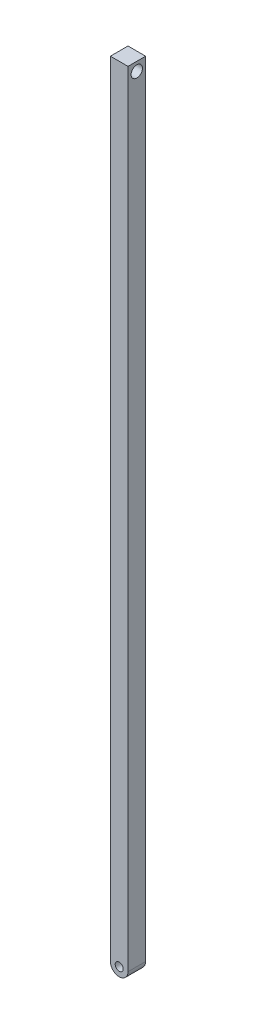
ISO-10303-21;
HEADER;
FILE_DESCRIPTION(('STEP AP214'),'2;1');
FILE_NAME('part.step','',(''),(''),'','','');
FILE_SCHEMA(('AUTOMOTIVE_DESIGN { 1 0 10303 214 1 1 1 1 }'));
ENDSEC;
DATA;
#1=APPLICATION_CONTEXT('core data for automotive mechanical design processes');
#2=APPLICATION_PROTOCOL_DEFINITION('international standard','automotive_design',2000,#1);
#3=PRODUCT_CONTEXT('',#1,'mechanical');
#4=PRODUCT('Part','Part','',(#3));
#5=PRODUCT_RELATED_PRODUCT_CATEGORY('part','',(#4));
#6=PRODUCT_DEFINITION_FORMATION('','',#4);
#7=PRODUCT_DEFINITION_CONTEXT('part definition',#1,'design');
#8=PRODUCT_DEFINITION('design','',#6,#7);
#9=PRODUCT_DEFINITION_SHAPE('','',#8);
#10=(LENGTH_UNIT() NAMED_UNIT(*) SI_UNIT(.MILLI.,.METRE.));
#11=(NAMED_UNIT(*) PLANE_ANGLE_UNIT() SI_UNIT($,.RADIAN.));
#12=(NAMED_UNIT(*) SI_UNIT($,.STERADIAN.) SOLID_ANGLE_UNIT());
#13=UNCERTAINTY_MEASURE_WITH_UNIT(LENGTH_MEASURE(1.E-05),#10,'distance_accuracy_value','');
#14=(GEOMETRIC_REPRESENTATION_CONTEXT(3) GLOBAL_UNCERTAINTY_ASSIGNED_CONTEXT((#13)) GLOBAL_UNIT_ASSIGNED_CONTEXT((#10,
#11,#12)) REPRESENTATION_CONTEXT('',''));
#15=CARTESIAN_POINT('',(0.,0.,0.));
#16=DIRECTION('',(0.,0.,1.));
#17=DIRECTION('',(1.,0.,0.));
#18=AXIS2_PLACEMENT_3D('',#15,#16,#17);
#19=CARTESIAN_POINT('',(3.94377337248894,-66.7561322893268,1.));
#20=DIRECTION('',(0.,0.,1.));
#21=DIRECTION('',(1.,0.,0.));
#22=AXIS2_PLACEMENT_3D('',#19,#20,#21);
#23=PLANE('',#22);
#24=DIRECTION('',(-1.,0.,0.));
#25=VECTOR('',#24,1.);
#26=CARTESIAN_POINT('',(3.44377337248929,-22.256132879046,1.));
#27=LINE('',#26,#25);
#28=CARTESIAN_POINT('',(4.44377337248859,-22.256132879046,1.));
#29=VERTEX_POINT('',#28);
#30=CARTESIAN_POINT('',(3.44377337248929,-22.256132879046,1.));
#31=VERTEX_POINT('',#30);
#32=EDGE_CURVE('E89',#29,#31,#27,.T.);
#33=ORIENTED_EDGE('',*,*,#32,.T.);
#34=DIRECTION('',(0.,-1.,0.));
#35=VECTOR('',#34,1.);
#36=CARTESIAN_POINT('',(3.44377337248929,-22.256132879046,1.));
#37=LINE('',#36,#35);
#38=CARTESIAN_POINT('',(3.4437733724893,-66.7561316995767,1.));
#39=VERTEX_POINT('',#38);
#40=EDGE_CURVE('E84',#31,#39,#37,.T.);
#41=ORIENTED_EDGE('',*,*,#40,.T.);
#42=CARTESIAN_POINT('',(3.94377337248894,-66.7561322893268,1.));
#43=DIRECTION('',(0.,0.,1.));
#44=DIRECTION('',(1.,0.,0.));
#45=AXIS2_PLACEMENT_3D('',#42,#43,#44);
#46=CIRCLE('',#45,0.499999999999994);
#47=CARTESIAN_POINT('',(4.44377337248859,-66.756132879046,1.));
#48=VERTEX_POINT('',#47);
#49=EDGE_CURVE('E87',#39,#48,#46,.T.);
#50=ORIENTED_EDGE('',*,*,#49,.T.);
#51=DIRECTION('',(0.,1.,0.));
#52=VECTOR('',#51,1.);
#53=CARTESIAN_POINT('',(4.44377337248859,-66.756132879046,1.));
#54=LINE('',#53,#52);
#55=EDGE_CURVE('E54',#48,#29,#54,.T.);
#56=ORIENTED_EDGE('',*,*,#55,.T.);
#57=EDGE_LOOP('',(#33,#41,#50,#56));
#58=FACE_BOUND('',#57,.T.);
#59=CARTESIAN_POINT('',(3.94377337248894,-66.7561322893268,1.));
#60=DIRECTION('',(0.,0.,1.));
#61=DIRECTION('',(1.,0.,0.));
#62=AXIS2_PLACEMENT_3D('',#59,#60,#61);
#63=CIRCLE('',#62,0.227761076804634);
#64=CARTESIAN_POINT('',(4.17153444929358,-66.7561322893268,1.));
#65=VERTEX_POINT('',#64);
#66=EDGE_CURVE('E104',#65,#65,#63,.T.);
#67=ORIENTED_EDGE('',*,*,#66,.F.);
#68=EDGE_LOOP('',(#67));
#69=FACE_BOUND('',#68,.T.);
#70=ADVANCED_FACE('F37',(#58,#69),#23,.T.);
#71=CARTESIAN_POINT('',(3.94377337248894,-66.7561322893268,0.));
#72=DIRECTION('',(0.,0.,1.));
#73=DIRECTION('',(1.,0.,0.));
#74=AXIS2_PLACEMENT_3D('',#71,#72,#73);
#75=PLANE('',#74);
#76=DIRECTION('',(-1.,0.,0.));
#77=VECTOR('',#76,1.);
#78=CARTESIAN_POINT('',(3.44377337248929,-22.256132879046,0.));
#79=LINE('',#78,#77);
#80=CARTESIAN_POINT('',(4.44377337248859,-22.256132879046,0.));
#81=VERTEX_POINT('',#80);
#82=CARTESIAN_POINT('',(3.44377337248929,-22.256132879046,0.));
#83=VERTEX_POINT('',#82);
#84=EDGE_CURVE('E101',#81,#83,#79,.T.);
#85=ORIENTED_EDGE('',*,*,#84,.F.);
#86=DIRECTION('',(0.,1.,0.));
#87=VECTOR('',#86,1.);
#88=CARTESIAN_POINT('',(4.44377337248859,-66.756132879046,0.));
#89=LINE('',#88,#87);
#90=CARTESIAN_POINT('',(4.44377337248859,-66.756132879046,0.));
#91=VERTEX_POINT('',#90);
#92=EDGE_CURVE('E77',#91,#81,#89,.T.);
#93=ORIENTED_EDGE('',*,*,#92,.F.);
#94=CARTESIAN_POINT('',(3.94377337248894,-66.7561322893268,0.));
#95=DIRECTION('',(0.,0.,1.));
#96=DIRECTION('',(1.,0.,0.));
#97=AXIS2_PLACEMENT_3D('',#94,#95,#96);
#98=CIRCLE('',#97,0.499999999999994);
#99=CARTESIAN_POINT('',(3.4437733724893,-66.7561316995767,0.));
#100=VERTEX_POINT('',#99);
#101=EDGE_CURVE('E71',#100,#91,#98,.T.);
#102=ORIENTED_EDGE('',*,*,#101,.F.);
#103=DIRECTION('',(0.,-1.,0.));
#104=VECTOR('',#103,1.);
#105=CARTESIAN_POINT('',(3.44377337248929,-22.256132879046,0.));
#106=LINE('',#105,#104);
#107=EDGE_CURVE('E93',#83,#100,#106,.T.);
#108=ORIENTED_EDGE('',*,*,#107,.F.);
#109=EDGE_LOOP('',(#85,#93,#102,#108));
#110=FACE_BOUND('',#109,.T.);
#111=CARTESIAN_POINT('',(3.94377337248894,-66.7561322893268,0.));
#112=DIRECTION('',(0.,0.,1.));
#113=DIRECTION('',(1.,0.,0.));
#114=AXIS2_PLACEMENT_3D('',#111,#112,#113);
#115=CIRCLE('',#114,0.227761076804634);
#116=CARTESIAN_POINT('',(4.17153444929358,-66.7561322893268,0.));
#117=VERTEX_POINT('',#116);
#118=EDGE_CURVE('E116',#117,#117,#115,.T.);
#119=ORIENTED_EDGE('',*,*,#118,.T.);
#120=EDGE_LOOP('',(#119));
#121=FACE_BOUND('',#120,.T.);
#122=ADVANCED_FACE('F112',(#110,#121),#75,.F.);
#123=CARTESIAN_POINT('',(3.44377337248929,-22.256132879046,1.));
#124=DIRECTION('',(0.,-1.,0.));
#125=DIRECTION('',(0.,0.,-1.));
#126=AXIS2_PLACEMENT_3D('',#123,#124,#125);
#127=PLANE('',#126);
#128=ORIENTED_EDGE('',*,*,#84,.T.);
#129=DIRECTION('',(0.,0.,-1.));
#130=VECTOR('',#129,1.);
#131=CARTESIAN_POINT('',(3.44377337248929,-22.256132879046,1.));
#132=LINE('',#131,#130);
#133=EDGE_CURVE('E11',#31,#83,#132,.T.);
#134=ORIENTED_EDGE('',*,*,#133,.F.);
#135=ORIENTED_EDGE('',*,*,#32,.F.);
#136=DIRECTION('',(0.,0.,-1.));
#137=VECTOR('',#136,1.);
#138=CARTESIAN_POINT('',(4.44377337248859,-22.256132879046,1.));
#139=LINE('',#138,#137);
#140=EDGE_CURVE('E97',#29,#81,#139,.T.);
#141=ORIENTED_EDGE('',*,*,#140,.T.);
#142=EDGE_LOOP('',(#128,#134,#135,#141));
#143=FACE_BOUND('',#142,.T.);
#144=ADVANCED_FACE('F39',(#143),#127,.F.);
#145=CARTESIAN_POINT('',(3.44377337248929,-22.256132879046,1.));
#146=DIRECTION('',(1.,0.,0.));
#147=DIRECTION('',(0.,1.,0.));
#148=AXIS2_PLACEMENT_3D('',#145,#146,#147);
#149=PLANE('',#148);
#150=CARTESIAN_POINT('',(3.44377337248895,-22.756132879046,0.5));
#151=DIRECTION('',(1.,0.,0.));
#152=DIRECTION('',(0.,1.,0.));
#153=AXIS2_PLACEMENT_3D('',#150,#151,#152);
#154=CIRCLE('',#153,0.323069994028577);
#155=CARTESIAN_POINT('',(3.44377337248895,-22.4330628850174,0.5));
#156=VERTEX_POINT('',#155);
#157=EDGE_CURVE('E119',#156,#156,#154,.T.);
#158=ORIENTED_EDGE('',*,*,#157,.T.);
#159=EDGE_LOOP('',(#158));
#160=FACE_BOUND('',#159,.T.);
#161=ORIENTED_EDGE('',*,*,#107,.T.);
#162=DIRECTION('',(0.,0.,-1.));
#163=VECTOR('',#162,1.);
#164=CARTESIAN_POINT('',(3.4437733724893,-66.7561316995767,1.));
#165=LINE('',#164,#163);
#166=EDGE_CURVE('E46',#39,#100,#165,.T.);
#167=ORIENTED_EDGE('',*,*,#166,.F.);
#168=ORIENTED_EDGE('',*,*,#40,.F.);
#169=ORIENTED_EDGE('',*,*,#133,.T.);
#170=EDGE_LOOP('',(#161,#167,#168,#169));
#171=FACE_BOUND('',#170,.T.);
#172=ADVANCED_FACE('F92',(#160,#171),#149,.F.);
#173=CARTESIAN_POINT('',(3.94377337248894,-66.7561322893268,1.));
#174=DIRECTION('',(0.,0.,-1.));
#175=DIRECTION('',(-1.,0.,0.));
#176=AXIS2_PLACEMENT_3D('',#173,#174,#175);
#177=CYLINDRICAL_SURFACE('',#176,0.499999999999994);
#178=ORIENTED_EDGE('',*,*,#101,.T.);
#179=DIRECTION('',(0.,0.,-1.));
#180=VECTOR('',#179,1.);
#181=CARTESIAN_POINT('',(4.44377337248859,-66.756132879046,1.));
#182=LINE('',#181,#180);
#183=EDGE_CURVE('E94',#48,#91,#182,.T.);
#184=ORIENTED_EDGE('',*,*,#183,.F.);
#185=ORIENTED_EDGE('',*,*,#49,.F.);
#186=ORIENTED_EDGE('',*,*,#166,.T.);
#187=EDGE_LOOP('',(#178,#184,#185,#186));
#188=FACE_BOUND('',#187,.T.);
#189=ADVANCED_FACE('F95',(#188),#177,.T.);
#190=CARTESIAN_POINT('',(4.44377337248859,-66.756132879046,1.));
#191=DIRECTION('',(-1.,0.,0.));
#192=DIRECTION('',(0.,-1.,0.));
#193=AXIS2_PLACEMENT_3D('',#190,#191,#192);
#194=PLANE('',#193);
#195=CARTESIAN_POINT('',(4.44377337248859,-22.756132879046,0.5));
#196=DIRECTION('',(1.,0.,0.));
#197=DIRECTION('',(0.,1.,0.));
#198=AXIS2_PLACEMENT_3D('',#195,#196,#197);
#199=CIRCLE('',#198,0.323069994028577);
#200=CARTESIAN_POINT('',(4.44377337248859,-22.4330628850174,0.5));
#201=VERTEX_POINT('',#200);
#202=EDGE_CURVE('E122',#201,#201,#199,.T.);
#203=ORIENTED_EDGE('',*,*,#202,.F.);
#204=EDGE_LOOP('',(#203));
#205=FACE_BOUND('',#204,.T.);
#206=ORIENTED_EDGE('',*,*,#92,.T.);
#207=ORIENTED_EDGE('',*,*,#140,.F.);
#208=ORIENTED_EDGE('',*,*,#55,.F.);
#209=ORIENTED_EDGE('',*,*,#183,.T.);
#210=EDGE_LOOP('',(#206,#207,#208,#209));
#211=FACE_BOUND('',#210,.T.);
#212=ADVANCED_FACE('F109',(#205,#211),#194,.F.);
#213=CARTESIAN_POINT('',(3.94377337248894,-66.7561322893268,1.));
#214=DIRECTION('',(0.,0.,-1.));
#215=DIRECTION('',(-1.,0.,0.));
#216=AXIS2_PLACEMENT_3D('',#213,#214,#215);
#217=CYLINDRICAL_SURFACE('',#216,0.227761076804634);
#218=ORIENTED_EDGE('',*,*,#66,.T.);
#219=EDGE_LOOP('',(#218));
#220=FACE_BOUND('',#219,.T.);
#221=ORIENTED_EDGE('',*,*,#118,.F.);
#222=EDGE_LOOP('',(#221));
#223=FACE_BOUND('',#222,.T.);
#224=ADVANCED_FACE('F132',(#220,#223),#217,.F.);
#225=CARTESIAN_POINT('',(3.44377337248895,-22.756132879046,0.5));
#226=DIRECTION('',(1.,0.,0.));
#227=DIRECTION('',(0.,1.,0.));
#228=AXIS2_PLACEMENT_3D('',#225,#226,#227);
#229=CYLINDRICAL_SURFACE('',#228,0.323069994028577);
#230=ORIENTED_EDGE('',*,*,#157,.F.);
#231=EDGE_LOOP('',(#230));
#232=FACE_BOUND('',#231,.T.);
#233=ORIENTED_EDGE('',*,*,#202,.T.);
#234=EDGE_LOOP('',(#233));
#235=FACE_BOUND('',#234,.T.);
#236=ADVANCED_FACE('F129',(#232,#235),#229,.F.);
#237=CLOSED_SHELL('',(#70,#122,#144,#172,#189,#212,#224,#236));
#238=MANIFOLD_SOLID_BREP('B2',#237);
#239=ADVANCED_BREP_SHAPE_REPRESENTATION('',(#18,#238),#14);
#240=SHAPE_DEFINITION_REPRESENTATION(#9,#239);
ENDSEC;
END-ISO-10303-21;
